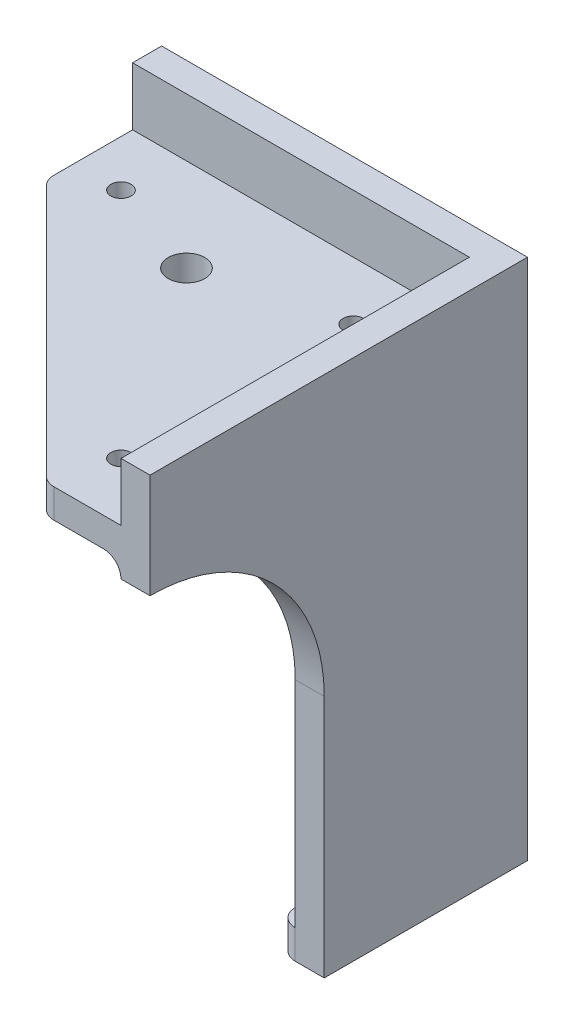
ISO-10303-21;
HEADER;
FILE_DESCRIPTION(('STEP AP214'),'2;1');
FILE_NAME('part.step','',(''),(''),'','','');
FILE_SCHEMA(('AUTOMOTIVE_DESIGN { 1 0 10303 214 1 1 1 1 }'));
ENDSEC;
DATA;
#1=APPLICATION_CONTEXT('core data for automotive mechanical design processes');
#2=APPLICATION_PROTOCOL_DEFINITION('international standard','automotive_design',2000,#1);
#3=PRODUCT_CONTEXT('',#1,'mechanical');
#4=PRODUCT('Part','Part','',(#3));
#5=PRODUCT_RELATED_PRODUCT_CATEGORY('part','',(#4));
#6=PRODUCT_DEFINITION_FORMATION('','',#4);
#7=PRODUCT_DEFINITION_CONTEXT('part definition',#1,'design');
#8=PRODUCT_DEFINITION('design','',#6,#7);
#9=PRODUCT_DEFINITION_SHAPE('','',#8);
#10=(LENGTH_UNIT() NAMED_UNIT(*) SI_UNIT(.MILLI.,.METRE.));
#11=(NAMED_UNIT(*) PLANE_ANGLE_UNIT() SI_UNIT($,.RADIAN.));
#12=(NAMED_UNIT(*) SI_UNIT($,.STERADIAN.) SOLID_ANGLE_UNIT());
#13=UNCERTAINTY_MEASURE_WITH_UNIT(LENGTH_MEASURE(1.E-05),#10,'distance_accuracy_value','');
#14=(GEOMETRIC_REPRESENTATION_CONTEXT(3) GLOBAL_UNCERTAINTY_ASSIGNED_CONTEXT((#13)) GLOBAL_UNIT_ASSIGNED_CONTEXT((#10,
#11,#12)) REPRESENTATION_CONTEXT('',''));
#15=CARTESIAN_POINT('',(0.,0.,0.));
#16=DIRECTION('',(0.,0.,1.));
#17=DIRECTION('',(1.,0.,0.));
#18=AXIS2_PLACEMENT_3D('',#15,#16,#17);
#19=CARTESIAN_POINT('',(-63.,-48.,5.));
#20=DIRECTION('',(0.,0.,1.));
#21=DIRECTION('',(1.,0.,0.));
#22=AXIS2_PLACEMENT_3D('',#19,#20,#21);
#23=PLANE('',#22);
#24=DIRECTION('',(0.,-1.,0.));
#25=VECTOR('',#24,1.);
#26=CARTESIAN_POINT('',(-7.99999999999996,-48.,5.));
#27=LINE('',#26,#25);
#28=CARTESIAN_POINT('',(-7.99999999999996,-85.,5.));
#29=VERTEX_POINT('',#28);
#30=CARTESIAN_POINT('',(-7.99999999999997,-18.,5.));
#31=VERTEX_POINT('',#30);
#32=EDGE_CURVE('E322',#29,#31,#27,.F.);
#33=ORIENTED_EDGE('',*,*,#32,.T.);
#34=DIRECTION('',(1.,0.,0.));
#35=VECTOR('',#34,1.);
#36=CARTESIAN_POINT('',(-63.,-18.,5.));
#37=LINE('',#36,#35);
#38=CARTESIAN_POINT('',(-63.,-18.,5.));
#39=VERTEX_POINT('',#38);
#40=EDGE_CURVE('E324',#31,#39,#37,.F.);
#41=ORIENTED_EDGE('',*,*,#40,.T.);
#42=CARTESIAN_POINT('',(-63.,-48.,5.));
#43=DIRECTION('',(0.,0.,-1.));
#44=DIRECTION('',(1.,0.,0.));
#45=AXIS2_PLACEMENT_3D('',#42,#43,#44);
#46=CIRCLE('',#45,30.);
#47=CARTESIAN_POINT('',(-33.,-48.,5.));
#48=VERTEX_POINT('',#47);
#49=EDGE_CURVE('E234',#39,#48,#46,.T.);
#50=ORIENTED_EDGE('',*,*,#49,.T.);
#51=DIRECTION('',(0.,-1.,0.));
#52=VECTOR('',#51,1.);
#53=CARTESIAN_POINT('',(-33.,-90.,5.));
#54=LINE('',#53,#52);
#55=CARTESIAN_POINT('',(-33.,-85.,5.));
#56=VERTEX_POINT('',#55);
#57=EDGE_CURVE('E237',#48,#56,#54,.T.);
#58=ORIENTED_EDGE('',*,*,#57,.T.);
#59=DIRECTION('',(1.,0.,0.));
#60=VECTOR('',#59,1.);
#61=CARTESIAN_POINT('',(-33.,-85.,5.));
#62=LINE('',#61,#60);
#63=EDGE_CURVE('E356',#56,#29,#62,.T.);
#64=ORIENTED_EDGE('',*,*,#63,.T.);
#65=EDGE_LOOP('',(#33,#41,#50,#58,#64));
#66=FACE_BOUND('',#65,.T.);
#67=ADVANCED_FACE('F33',(#66),#23,.T.);
#68=DIRECTION('',(0.,-1.,0.));
#69=VECTOR('',#68,1.);
#70=CARTESIAN_POINT('',(-63.,-18.,5.));
#71=LINE('',#70,#69);
#72=CARTESIAN_POINT('',(-63.,0.,5.));
#73=VERTEX_POINT('',#72);
#74=CARTESIAN_POINT('',(-63.,-10.,5.));
#75=VERTEX_POINT('',#74);
#76=EDGE_CURVE('E206',#73,#75,#71,.T.);
#77=ORIENTED_EDGE('',*,*,#76,.T.);
#78=DIRECTION('',(-1.,0.,0.));
#79=VECTOR('',#78,1.);
#80=CARTESIAN_POINT('',(-4.99999999999996,-10.,5.));
#81=LINE('',#80,#79);
#82=CARTESIAN_POINT('',(-4.99999999999996,-10.,5.));
#83=VERTEX_POINT('',#82);
#84=EDGE_CURVE('E190',#83,#75,#81,.T.);
#85=ORIENTED_EDGE('',*,*,#84,.F.);
#86=DIRECTION('',(0.,-1.,0.));
#87=VECTOR('',#86,1.);
#88=CARTESIAN_POINT('',(-4.99999999999997,0.,5.));
#89=LINE('',#88,#87);
#90=CARTESIAN_POINT('',(-4.99999999999996,0.,5.));
#91=VERTEX_POINT('',#90);
#92=EDGE_CURVE('E203',#91,#83,#89,.T.);
#93=ORIENTED_EDGE('',*,*,#92,.F.);
#94=DIRECTION('',(-1.,0.,0.));
#95=VECTOR('',#94,1.);
#96=CARTESIAN_POINT('',(-63.,0.,5.));
#97=LINE('',#96,#95);
#98=EDGE_CURVE('E224',#91,#73,#97,.T.);
#99=ORIENTED_EDGE('',*,*,#98,.T.);
#100=EDGE_LOOP('',(#77,#85,#93,#99));
#101=FACE_BOUND('',#100,.T.);
#102=ADVANCED_FACE('F202',(#101),#23,.T.);
#103=CARTESIAN_POINT('',(-4.99999999999997,0.,65.));
#104=DIRECTION('',(1.,0.,0.));
#105=DIRECTION('',(0.,1.,0.));
#106=AXIS2_PLACEMENT_3D('',#103,#104,#105);
#107=PLANE('',#106);
#108=CARTESIAN_POINT('',(-4.99999999999998,-48.,65.));
#109=DIRECTION('',(1.,0.,0.));
#110=DIRECTION('',(0.,1.,0.));
#111=AXIS2_PLACEMENT_3D('',#108,#109,#110);
#112=CIRCLE('',#111,30.);
#113=CARTESIAN_POINT('',(-4.99999999999998,-18.,65.));
#114=VERTEX_POINT('',#113);
#115=CARTESIAN_POINT('',(-4.99999999999997,-48.,35.));
#116=VERTEX_POINT('',#115);
#117=EDGE_CURVE('E215',#114,#116,#112,.F.);
#118=ORIENTED_EDGE('',*,*,#117,.F.);
#119=DIRECTION('',(0.,0.,-1.));
#120=VECTOR('',#119,1.);
#121=CARTESIAN_POINT('',(-4.99999999999997,-18.,5.));
#122=LINE('',#121,#120);
#123=CARTESIAN_POINT('',(-4.99999999999997,-18.,8.));
#124=VERTEX_POINT('',#123);
#125=EDGE_CURVE('E50',#114,#124,#122,.T.);
#126=ORIENTED_EDGE('',*,*,#125,.T.);
#127=DIRECTION('',(0.,-1.,0.));
#128=VECTOR('',#127,1.);
#129=CARTESIAN_POINT('',(-4.99999999999997,0.,8.));
#130=LINE('',#129,#128);
#131=CARTESIAN_POINT('',(-4.99999999999996,-85.,8.));
#132=VERTEX_POINT('',#131);
#133=EDGE_CURVE('E54',#124,#132,#130,.T.);
#134=ORIENTED_EDGE('',*,*,#133,.T.);
#135=DIRECTION('',(0.,0.,1.));
#136=VECTOR('',#135,1.);
#137=CARTESIAN_POINT('',(-4.99999999999996,-85.,5.));
#138=LINE('',#137,#136);
#139=CARTESIAN_POINT('',(-4.99999999999996,-85.,35.));
#140=VERTEX_POINT('',#139);
#141=EDGE_CURVE('E359',#132,#140,#138,.T.);
#142=ORIENTED_EDGE('',*,*,#141,.T.);
#143=DIRECTION('',(0.,-1.,0.));
#144=VECTOR('',#143,1.);
#145=CARTESIAN_POINT('',(-4.99999999999996,-90.,35.));
#146=LINE('',#145,#144);
#147=EDGE_CURVE('E219',#116,#140,#146,.T.);
#148=ORIENTED_EDGE('',*,*,#147,.F.);
#149=EDGE_LOOP('',(#118,#126,#134,#142,#148));
#150=FACE_BOUND('',#149,.T.);
#151=ADVANCED_FACE('F427',(#150),#107,.F.);
#152=DIRECTION('',(0.,0.,-1.));
#153=VECTOR('',#152,1.);
#154=CARTESIAN_POINT('',(-4.99999999999996,-10.,123.215118311312));
#155=LINE('',#154,#153);
#156=CARTESIAN_POINT('',(-4.99999999999996,-10.,65.));
#157=VERTEX_POINT('',#156);
#158=EDGE_CURVE('E185',#157,#83,#155,.T.);
#159=ORIENTED_EDGE('',*,*,#158,.F.);
#160=DIRECTION('',(0.,-1.,0.));
#161=VECTOR('',#160,1.);
#162=CARTESIAN_POINT('',(-4.99999999999997,0.,65.));
#163=LINE('',#162,#161);
#164=CARTESIAN_POINT('',(-4.99999999999997,0.,65.));
#165=VERTEX_POINT('',#164);
#166=EDGE_CURVE('E231',#165,#157,#163,.T.);
#167=ORIENTED_EDGE('',*,*,#166,.F.);
#168=DIRECTION('',(0.,0.,-1.));
#169=VECTOR('',#168,1.);
#170=CARTESIAN_POINT('',(-4.99999999999997,0.,65.));
#171=LINE('',#170,#169);
#172=EDGE_CURVE('E213',#165,#91,#171,.T.);
#173=ORIENTED_EDGE('',*,*,#172,.T.);
#174=ORIENTED_EDGE('',*,*,#92,.T.);
#175=EDGE_LOOP('',(#159,#167,#173,#174));
#176=FACE_BOUND('',#175,.T.);
#177=ADVANCED_FACE('F211',(#176),#107,.F.);
#178=CARTESIAN_POINT('',(-63.,-18.,5.));
#179=DIRECTION('',(1.,0.,0.));
#180=DIRECTION('',(0.,1.,0.));
#181=AXIS2_PLACEMENT_3D('',#178,#179,#180);
#182=PLANE('',#181);
#183=DIRECTION('',(0.,0.,-1.));
#184=VECTOR('',#183,1.);
#185=CARTESIAN_POINT('',(-63.,-15.,123.215118311312));
#186=LINE('',#185,#184);
#187=CARTESIAN_POINT('',(-63.,-15.,18.575));
#188=VERTEX_POINT('',#187);
#189=CARTESIAN_POINT('',(-63.,-15.,8.00000000000004));
#190=VERTEX_POINT('',#189);
#191=EDGE_CURVE('E207',#188,#190,#186,.T.);
#192=ORIENTED_EDGE('',*,*,#191,.F.);
#193=DIRECTION('',(0.,1.,0.));
#194=VECTOR('',#193,1.);
#195=CARTESIAN_POINT('',(-63.,-18.,18.575));
#196=LINE('',#195,#194);
#197=CARTESIAN_POINT('',(-63.,-10.,18.575));
#198=VERTEX_POINT('',#197);
#199=EDGE_CURVE('E314',#188,#198,#196,.T.);
#200=ORIENTED_EDGE('',*,*,#199,.T.);
#201=DIRECTION('',(0.,0.,-1.));
#202=VECTOR('',#201,1.);
#203=CARTESIAN_POINT('',(-63.,-10.,123.215118311312));
#204=LINE('',#203,#202);
#205=EDGE_CURVE('E199',#198,#75,#204,.T.);
#206=ORIENTED_EDGE('',*,*,#205,.T.);
#207=ORIENTED_EDGE('',*,*,#76,.F.);
#208=DIRECTION('',(0.,0.,-1.));
#209=VECTOR('',#208,1.);
#210=CARTESIAN_POINT('',(-63.,0.,5.));
#211=LINE('',#210,#209);
#212=CARTESIAN_POINT('',(-63.,0.,0.));
#213=VERTEX_POINT('',#212);
#214=EDGE_CURVE('E255',#73,#213,#211,.T.);
#215=ORIENTED_EDGE('',*,*,#214,.T.);
#216=DIRECTION('',(0.,-1.,0.));
#217=VECTOR('',#216,1.);
#218=CARTESIAN_POINT('',(-63.,-18.,0.));
#219=LINE('',#218,#217);
#220=CARTESIAN_POINT('',(-63.,-18.,0.));
#221=VERTEX_POINT('',#220);
#222=EDGE_CURVE('E241',#213,#221,#219,.T.);
#223=ORIENTED_EDGE('',*,*,#222,.T.);
#224=DIRECTION('',(0.,0.,-1.));
#225=VECTOR('',#224,1.);
#226=CARTESIAN_POINT('',(-63.,-18.,5.));
#227=LINE('',#226,#225);
#228=EDGE_CURVE('E267',#39,#221,#227,.T.);
#229=ORIENTED_EDGE('',*,*,#228,.F.);
#230=CARTESIAN_POINT('',(-63.,-18.,8.00000000000001));
#231=DIRECTION('',(1.,0.,0.));
#232=DIRECTION('',(0.,1.,0.));
#233=AXIS2_PLACEMENT_3D('',#230,#231,#232);
#234=CIRCLE('',#233,3.);
#235=EDGE_CURVE('E42',#39,#190,#234,.T.);
#236=ORIENTED_EDGE('',*,*,#235,.T.);
#237=EDGE_LOOP('',(#192,#200,#206,#207,#215,#223,#229,#236));
#238=FACE_BOUND('',#237,.T.);
#239=ADVANCED_FACE('F404',(#238),#182,.F.);
#240=CARTESIAN_POINT('',(-63.,-48.,5.));
#241=DIRECTION('',(0.,0.,-1.));
#242=DIRECTION('',(-1.,0.,0.));
#243=AXIS2_PLACEMENT_3D('',#240,#241,#242);
#244=CYLINDRICAL_SURFACE('',#243,30.);
#245=CARTESIAN_POINT('',(-63.,-48.,0.));
#246=DIRECTION('',(0.,0.,-1.));
#247=DIRECTION('',(1.,0.,0.));
#248=AXIS2_PLACEMENT_3D('',#245,#246,#247);
#249=CIRCLE('',#248,30.);
#250=CARTESIAN_POINT('',(-33.,-48.,0.));
#251=VERTEX_POINT('',#250);
#252=EDGE_CURVE('E244',#221,#251,#249,.T.);
#253=ORIENTED_EDGE('',*,*,#252,.T.);
#254=DIRECTION('',(0.,0.,-1.));
#255=VECTOR('',#254,1.);
#256=CARTESIAN_POINT('',(-33.,-48.,5.));
#257=LINE('',#256,#255);
#258=EDGE_CURVE('E265',#48,#251,#257,.T.);
#259=ORIENTED_EDGE('',*,*,#258,.F.);
#260=ORIENTED_EDGE('',*,*,#49,.F.);
#261=ORIENTED_EDGE('',*,*,#228,.T.);
#262=EDGE_LOOP('',(#253,#259,#260,#261));
#263=FACE_BOUND('',#262,.T.);
#264=ADVANCED_FACE('F450',(#263),#244,.F.);
#265=CARTESIAN_POINT('',(-33.,-90.,5.));
#266=DIRECTION('',(1.,0.,0.));
#267=DIRECTION('',(0.,0.,-1.));
#268=AXIS2_PLACEMENT_3D('',#265,#266,#267);
#269=PLANE('',#268);
#270=DIRECTION('',(0.,0.,-1.));
#271=VECTOR('',#270,1.);
#272=CARTESIAN_POINT('',(-33.,-90.,5.));
#273=LINE('',#272,#271);
#274=CARTESIAN_POINT('',(-33.,-90.,5.));
#275=VERTEX_POINT('',#274);
#276=CARTESIAN_POINT('',(-33.,-90.,0.));
#277=VERTEX_POINT('',#276);
#278=EDGE_CURVE('E263',#275,#277,#273,.T.);
#279=ORIENTED_EDGE('',*,*,#278,.F.);
#280=DIRECTION('',(0.,-1.,0.));
#281=VECTOR('',#280,1.);
#282=CARTESIAN_POINT('',(-33.,-85.,5.));
#283=LINE('',#282,#281);
#284=EDGE_CURVE('E286',#275,#56,#283,.F.);
#285=ORIENTED_EDGE('',*,*,#284,.T.);
#286=ORIENTED_EDGE('',*,*,#57,.F.);
#287=ORIENTED_EDGE('',*,*,#258,.T.);
#288=DIRECTION('',(0.,-1.,0.));
#289=VECTOR('',#288,1.);
#290=CARTESIAN_POINT('',(-33.,-90.,0.));
#291=LINE('',#290,#289);
#292=EDGE_CURVE('E246',#251,#277,#291,.T.);
#293=ORIENTED_EDGE('',*,*,#292,.T.);
#294=EDGE_LOOP('',(#279,#285,#286,#287,#293));
#295=FACE_BOUND('',#294,.T.);
#296=ADVANCED_FACE('F446',(#295),#269,.F.);
#297=CARTESIAN_POINT('',(0.,-90.,5.));
#298=DIRECTION('',(0.,1.,0.));
#299=DIRECTION('',(0.,0.,1.));
#300=AXIS2_PLACEMENT_3D('',#297,#298,#299);
#301=PLANE('',#300);
#302=DIRECTION('',(-1.,0.,0.));
#303=VECTOR('',#302,1.);
#304=CARTESIAN_POINT('',(-33.,-90.,8.));
#305=LINE('',#304,#303);
#306=CARTESIAN_POINT('',(-7.99999999999996,-90.,8.));
#307=VERTEX_POINT('',#306);
#308=CARTESIAN_POINT('',(-30.,-90.,8.));
#309=VERTEX_POINT('',#308);
#310=EDGE_CURVE('E360',#307,#309,#305,.T.);
#311=ORIENTED_EDGE('',*,*,#310,.T.);
#312=CARTESIAN_POINT('',(-30.,-90.,5.));
#313=DIRECTION('',(0.,1.,0.));
#314=DIRECTION('',(0.,0.,1.));
#315=AXIS2_PLACEMENT_3D('',#312,#313,#314);
#316=CIRCLE('',#315,3.);
#317=EDGE_CURVE('E281',#309,#275,#316,.F.);
#318=ORIENTED_EDGE('',*,*,#317,.T.);
#319=ORIENTED_EDGE('',*,*,#278,.T.);
#320=DIRECTION('',(1.,0.,0.));
#321=VECTOR('',#320,1.);
#322=CARTESIAN_POINT('',(0.,-90.,0.));
#323=LINE('',#322,#321);
#324=CARTESIAN_POINT('',(0.,-90.,0.));
#325=VERTEX_POINT('',#324);
#326=EDGE_CURVE('E249',#277,#325,#323,.T.);
#327=ORIENTED_EDGE('',*,*,#326,.T.);
#328=DIRECTION('',(0.,0.,-1.));
#329=VECTOR('',#328,1.);
#330=CARTESIAN_POINT('',(0.,-90.,5.));
#331=LINE('',#330,#329);
#332=CARTESIAN_POINT('',(0.,-90.,35.));
#333=VERTEX_POINT('',#332);
#334=EDGE_CURVE('E261',#333,#325,#331,.T.);
#335=ORIENTED_EDGE('',*,*,#334,.F.);
#336=DIRECTION('',(1.,0.,0.));
#337=VECTOR('',#336,1.);
#338=CARTESIAN_POINT('',(-82.9999999999999,-90.,35.));
#339=LINE('',#338,#337);
#340=CARTESIAN_POINT('',(-4.99999999999996,-90.,35.));
#341=VERTEX_POINT('',#340);
#342=EDGE_CURVE('E379',#341,#333,#339,.T.);
#343=ORIENTED_EDGE('',*,*,#342,.F.);
#344=CARTESIAN_POINT('',(-4.99999999999996,-90.,32.));
#345=DIRECTION('',(0.,1.,0.));
#346=DIRECTION('',(0.,0.,1.));
#347=AXIS2_PLACEMENT_3D('',#344,#345,#346);
#348=CIRCLE('',#347,3.);
#349=CARTESIAN_POINT('',(-7.99999999999996,-90.,32.));
#350=VERTEX_POINT('',#349);
#351=EDGE_CURVE('E274',#341,#350,#348,.F.);
#352=ORIENTED_EDGE('',*,*,#351,.T.);
#353=DIRECTION('',(0.,0.,-1.));
#354=VECTOR('',#353,1.);
#355=CARTESIAN_POINT('',(-7.99999999999996,-90.,8.));
#356=LINE('',#355,#354);
#357=EDGE_CURVE('E350',#350,#307,#356,.T.);
#358=ORIENTED_EDGE('',*,*,#357,.T.);
#359=EDGE_LOOP('',(#311,#318,#319,#327,#335,#343,#352,#358));
#360=FACE_BOUND('',#359,.T.);
#361=ADVANCED_FACE('F442',(#360),#301,.F.);
#362=CARTESIAN_POINT('',(0.,0.,5.));
#363=DIRECTION('',(-1.,0.,0.));
#364=DIRECTION('',(0.,-1.,0.));
#365=AXIS2_PLACEMENT_3D('',#362,#363,#364);
#366=PLANE('',#365);
#367=DIRECTION('',(0.,1.,0.));
#368=VECTOR('',#367,1.);
#369=CARTESIAN_POINT('',(0.,0.,65.));
#370=LINE('',#369,#368);
#371=CARTESIAN_POINT('',(0.,-18.,65.));
#372=VERTEX_POINT('',#371);
#373=CARTESIAN_POINT('',(0.,0.,65.));
#374=VERTEX_POINT('',#373);
#375=EDGE_CURVE('E214',#372,#374,#370,.T.);
#376=ORIENTED_EDGE('',*,*,#375,.F.);
#377=CARTESIAN_POINT('',(0.,-48.,65.));
#378=DIRECTION('',(1.,0.,0.));
#379=DIRECTION('',(0.,1.,0.));
#380=AXIS2_PLACEMENT_3D('',#377,#378,#379);
#381=CIRCLE('',#380,30.);
#382=CARTESIAN_POINT('',(0.,-48.,35.));
#383=VERTEX_POINT('',#382);
#384=EDGE_CURVE('E377',#383,#372,#381,.T.);
#385=ORIENTED_EDGE('',*,*,#384,.F.);
#386=DIRECTION('',(0.,1.,0.));
#387=VECTOR('',#386,1.);
#388=CARTESIAN_POINT('',(0.,-90.,35.));
#389=LINE('',#388,#387);
#390=EDGE_CURVE('E371',#333,#383,#389,.T.);
#391=ORIENTED_EDGE('',*,*,#390,.F.);
#392=ORIENTED_EDGE('',*,*,#334,.T.);
#393=DIRECTION('',(0.,1.,0.));
#394=VECTOR('',#393,1.);
#395=CARTESIAN_POINT('',(0.,0.,0.));
#396=LINE('',#395,#394);
#397=CARTESIAN_POINT('',(0.,0.,0.));
#398=VERTEX_POINT('',#397);
#399=EDGE_CURVE('E252',#325,#398,#396,.T.);
#400=ORIENTED_EDGE('',*,*,#399,.T.);
#401=DIRECTION('',(0.,0.,-1.));
#402=VECTOR('',#401,1.);
#403=CARTESIAN_POINT('',(0.,0.,5.));
#404=LINE('',#403,#402);
#405=EDGE_CURVE('E258',#374,#398,#404,.T.);
#406=ORIENTED_EDGE('',*,*,#405,.F.);
#407=EDGE_LOOP('',(#376,#385,#391,#392,#400,#406));
#408=FACE_BOUND('',#407,.T.);
#409=ADVANCED_FACE('F438',(#408),#366,.F.);
#410=CARTESIAN_POINT('',(-63.,0.,5.));
#411=DIRECTION('',(0.,-1.,0.));
#412=DIRECTION('',(0.,0.,-1.));
#413=AXIS2_PLACEMENT_3D('',#410,#411,#412);
#414=PLANE('',#413);
#415=DIRECTION('',(-1.,0.,0.));
#416=VECTOR('',#415,1.);
#417=CARTESIAN_POINT('',(-63.,0.,0.));
#418=LINE('',#417,#416);
#419=EDGE_CURVE('E235',#398,#213,#418,.T.);
#420=ORIENTED_EDGE('',*,*,#419,.T.);
#421=ORIENTED_EDGE('',*,*,#214,.F.);
#422=ORIENTED_EDGE('',*,*,#98,.F.);
#423=ORIENTED_EDGE('',*,*,#172,.F.);
#424=DIRECTION('',(-1.,0.,0.));
#425=VECTOR('',#424,1.);
#426=CARTESIAN_POINT('',(0.,0.,65.));
#427=LINE('',#426,#425);
#428=EDGE_CURVE('E217',#374,#165,#427,.T.);
#429=ORIENTED_EDGE('',*,*,#428,.F.);
#430=ORIENTED_EDGE('',*,*,#405,.T.);
#431=EDGE_LOOP('',(#420,#421,#422,#423,#429,#430));
#432=FACE_BOUND('',#431,.T.);
#433=ADVANCED_FACE('F434',(#432),#414,.F.);
#434=CARTESIAN_POINT('',(-63.,-48.,0.));
#435=DIRECTION('',(0.,0.,1.));
#436=DIRECTION('',(1.,0.,0.));
#437=AXIS2_PLACEMENT_3D('',#434,#435,#436);
#438=PLANE('',#437);
#439=ORIENTED_EDGE('',*,*,#222,.F.);
#440=ORIENTED_EDGE('',*,*,#419,.F.);
#441=ORIENTED_EDGE('',*,*,#399,.F.);
#442=ORIENTED_EDGE('',*,*,#326,.F.);
#443=ORIENTED_EDGE('',*,*,#292,.F.);
#444=ORIENTED_EDGE('',*,*,#252,.F.);
#445=EDGE_LOOP('',(#439,#440,#441,#442,#443,#444));
#446=FACE_BOUND('',#445,.T.);
#447=ADVANCED_FACE('F431',(#446),#438,.F.);
#448=CARTESIAN_POINT('',(0.,0.,65.));
#449=DIRECTION('',(0.,0.,-1.));
#450=DIRECTION('',(-1.,0.,0.));
#451=AXIS2_PLACEMENT_3D('',#448,#449,#450);
#452=PLANE('',#451);
#453=DIRECTION('',(1.,0.,0.));
#454=VECTOR('',#453,1.);
#455=CARTESIAN_POINT('',(-4.99999999999996,-10.,65.));
#456=LINE('',#455,#454);
#457=CARTESIAN_POINT('',(-16.5750000000005,-10.,65.));
#458=VERTEX_POINT('',#457);
#459=EDGE_CURVE('E193',#458,#157,#456,.T.);
#460=ORIENTED_EDGE('',*,*,#459,.F.);
#461=DIRECTION('',(0.,1.,0.));
#462=VECTOR('',#461,1.);
#463=CARTESIAN_POINT('',(-16.5750000000005,0.,65.));
#464=LINE('',#463,#462);
#465=CARTESIAN_POINT('',(-16.5750000000005,-15.,65.));
#466=VERTEX_POINT('',#465);
#467=EDGE_CURVE('E307',#458,#466,#464,.F.);
#468=ORIENTED_EDGE('',*,*,#467,.T.);
#469=DIRECTION('',(-1.,0.,0.));
#470=VECTOR('',#469,1.);
#471=CARTESIAN_POINT('',(-4.99999999999996,-15.,65.));
#472=LINE('',#471,#470);
#473=CARTESIAN_POINT('',(-7.99999999999997,-15.,65.));
#474=VERTEX_POINT('',#473);
#475=EDGE_CURVE('E198',#474,#466,#472,.T.);
#476=ORIENTED_EDGE('',*,*,#475,.F.);
#477=CARTESIAN_POINT('',(-7.99999999999997,-18.,65.));
#478=DIRECTION('',(0.,0.,-1.));
#479=DIRECTION('',(-1.,0.,0.));
#480=AXIS2_PLACEMENT_3D('',#477,#478,#479);
#481=CIRCLE('',#480,3.);
#482=EDGE_CURVE('E11',#474,#114,#481,.T.);
#483=ORIENTED_EDGE('',*,*,#482,.T.);
#484=DIRECTION('',(1.,0.,0.));
#485=VECTOR('',#484,1.);
#486=CARTESIAN_POINT('',(-83.,-18.,65.));
#487=LINE('',#486,#485);
#488=EDGE_CURVE('E373',#114,#372,#487,.T.);
#489=ORIENTED_EDGE('',*,*,#488,.T.);
#490=ORIENTED_EDGE('',*,*,#375,.T.);
#491=ORIENTED_EDGE('',*,*,#428,.T.);
#492=ORIENTED_EDGE('',*,*,#166,.T.);
#493=EDGE_LOOP('',(#460,#468,#476,#483,#489,#490,#491,#492));
#494=FACE_BOUND('',#493,.T.);
#495=ADVANCED_FACE('F386',(#494),#452,.F.);
#496=CARTESIAN_POINT('',(-82.9999999999999,-48.,65.));
#497=DIRECTION('',(1.,0.,0.));
#498=DIRECTION('',(0.,1.,0.));
#499=AXIS2_PLACEMENT_3D('',#496,#497,#498);
#500=CYLINDRICAL_SURFACE('',#499,30.);
#501=ORIENTED_EDGE('',*,*,#117,.T.);
#502=DIRECTION('',(1.,0.,0.));
#503=VECTOR('',#502,1.);
#504=CARTESIAN_POINT('',(-82.9999999999999,-48.,35.));
#505=LINE('',#504,#503);
#506=EDGE_CURVE('E382',#116,#383,#505,.T.);
#507=ORIENTED_EDGE('',*,*,#506,.T.);
#508=ORIENTED_EDGE('',*,*,#384,.T.);
#509=ORIENTED_EDGE('',*,*,#488,.F.);
#510=EDGE_LOOP('',(#501,#507,#508,#509));
#511=FACE_BOUND('',#510,.T.);
#512=ADVANCED_FACE('F574',(#511),#500,.F.);
#513=CARTESIAN_POINT('',(-82.9999999999999,-90.,35.));
#514=DIRECTION('',(0.,0.,-1.));
#515=DIRECTION('',(0.,1.,0.));
#516=AXIS2_PLACEMENT_3D('',#513,#514,#515);
#517=PLANE('',#516);
#518=ORIENTED_EDGE('',*,*,#147,.T.);
#519=DIRECTION('',(0.,-1.,0.));
#520=VECTOR('',#519,1.);
#521=CARTESIAN_POINT('',(-4.99999999999996,-90.,35.));
#522=LINE('',#521,#520);
#523=EDGE_CURVE('E293',#140,#341,#522,.T.);
#524=ORIENTED_EDGE('',*,*,#523,.T.);
#525=ORIENTED_EDGE('',*,*,#342,.T.);
#526=ORIENTED_EDGE('',*,*,#390,.T.);
#527=ORIENTED_EDGE('',*,*,#506,.F.);
#528=EDGE_LOOP('',(#518,#524,#525,#526,#527));
#529=FACE_BOUND('',#528,.T.);
#530=ADVANCED_FACE('F643',(#529),#517,.F.);
#531=CARTESIAN_POINT('',(-33.,-85.,8.));
#532=DIRECTION('',(0.,0.,1.));
#533=DIRECTION('',(1.,0.,0.));
#534=AXIS2_PLACEMENT_3D('',#531,#532,#533);
#535=PLANE('',#534);
#536=DIRECTION('',(-1.,0.,0.));
#537=VECTOR('',#536,1.);
#538=CARTESIAN_POINT('',(-33.,-85.,8.));
#539=LINE('',#538,#537);
#540=CARTESIAN_POINT('',(-7.99999999999996,-85.,8.));
#541=VERTEX_POINT('',#540);
#542=CARTESIAN_POINT('',(-30.,-85.,8.));
#543=VERTEX_POINT('',#542);
#544=EDGE_CURVE('E364',#541,#543,#539,.T.);
#545=ORIENTED_EDGE('',*,*,#544,.T.);
#546=DIRECTION('',(0.,-1.,0.));
#547=VECTOR('',#546,1.);
#548=CARTESIAN_POINT('',(-30.,-90.,8.));
#549=LINE('',#548,#547);
#550=EDGE_CURVE('E269',#543,#309,#549,.T.);
#551=ORIENTED_EDGE('',*,*,#550,.T.);
#552=ORIENTED_EDGE('',*,*,#310,.F.);
#553=DIRECTION('',(0.,-1.,0.));
#554=VECTOR('',#553,1.);
#555=CARTESIAN_POINT('',(-7.99999999999996,-85.,8.));
#556=LINE('',#555,#554);
#557=EDGE_CURVE('E366',#541,#307,#556,.T.);
#558=ORIENTED_EDGE('',*,*,#557,.F.);
#559=EDGE_LOOP('',(#545,#551,#552,#558));
#560=FACE_BOUND('',#559,.T.);
#561=ADVANCED_FACE('F634',(#560),#535,.T.);
#562=CARTESIAN_POINT('',(-7.99999999999996,-85.,8.));
#563=DIRECTION('',(-1.,0.,0.));
#564=DIRECTION('',(0.,-1.,0.));
#565=AXIS2_PLACEMENT_3D('',#562,#563,#564);
#566=PLANE('',#565);
#567=ORIENTED_EDGE('',*,*,#357,.F.);
#568=DIRECTION('',(0.,-1.,0.));
#569=VECTOR('',#568,1.);
#570=CARTESIAN_POINT('',(-7.99999999999996,-85.,32.));
#571=LINE('',#570,#569);
#572=CARTESIAN_POINT('',(-7.99999999999996,-85.,32.));
#573=VERTEX_POINT('',#572);
#574=EDGE_CURVE('E296',#350,#573,#571,.F.);
#575=ORIENTED_EDGE('',*,*,#574,.T.);
#576=DIRECTION('',(0.,0.,-1.));
#577=VECTOR('',#576,1.);
#578=CARTESIAN_POINT('',(-7.99999999999996,-85.,8.));
#579=LINE('',#578,#577);
#580=EDGE_CURVE('E362',#573,#541,#579,.T.);
#581=ORIENTED_EDGE('',*,*,#580,.T.);
#582=ORIENTED_EDGE('',*,*,#557,.T.);
#583=EDGE_LOOP('',(#567,#575,#581,#582));
#584=FACE_BOUND('',#583,.T.);
#585=ADVANCED_FACE('F626',(#584),#566,.T.);
#586=CARTESIAN_POINT('',(0.,-85.,0.));
#587=DIRECTION('',(0.,1.,0.));
#588=DIRECTION('',(0.,0.,1.));
#589=AXIS2_PLACEMENT_3D('',#586,#587,#588);
#590=PLANE('',#589);
#591=ORIENTED_EDGE('',*,*,#141,.F.);
#592=CARTESIAN_POINT('',(-7.99999999999996,-85.,8.));
#593=DIRECTION('',(0.,1.,0.));
#594=DIRECTION('',(0.,0.,1.));
#595=AXIS2_PLACEMENT_3D('',#592,#593,#594);
#596=CIRCLE('',#595,3.);
#597=EDGE_CURVE('E328',#132,#29,#596,.T.);
#598=ORIENTED_EDGE('',*,*,#597,.T.);
#599=ORIENTED_EDGE('',*,*,#63,.F.);
#600=CARTESIAN_POINT('',(-30.,-85.,5.));
#601=DIRECTION('',(0.,1.,0.));
#602=DIRECTION('',(0.,0.,1.));
#603=AXIS2_PLACEMENT_3D('',#600,#601,#602);
#604=CIRCLE('',#603,3.);
#605=EDGE_CURVE('E291',#56,#543,#604,.T.);
#606=ORIENTED_EDGE('',*,*,#605,.T.);
#607=ORIENTED_EDGE('',*,*,#544,.F.);
#608=ORIENTED_EDGE('',*,*,#580,.F.);
#609=CARTESIAN_POINT('',(-4.99999999999996,-85.,32.));
#610=DIRECTION('',(0.,1.,0.));
#611=DIRECTION('',(0.,0.,1.));
#612=AXIS2_PLACEMENT_3D('',#609,#610,#611);
#613=CIRCLE('',#612,3.);
#614=EDGE_CURVE('E288',#573,#140,#613,.T.);
#615=ORIENTED_EDGE('',*,*,#614,.T.);
#616=EDGE_LOOP('',(#591,#598,#599,#606,#607,#608,#615));
#617=FACE_BOUND('',#616,.T.);
#618=ADVANCED_FACE('F460',(#617),#590,.T.);
#619=CARTESIAN_POINT('',(-30.,-85.,5.));
#620=DIRECTION('',(0.,1.,0.));
#621=DIRECTION('',(0.,0.,1.));
#622=AXIS2_PLACEMENT_3D('',#619,#620,#621);
#623=CYLINDRICAL_SURFACE('',#622,3.);
#624=ORIENTED_EDGE('',*,*,#605,.F.);
#625=ORIENTED_EDGE('',*,*,#284,.F.);
#626=ORIENTED_EDGE('',*,*,#317,.F.);
#627=ORIENTED_EDGE('',*,*,#550,.F.);
#628=EDGE_LOOP('',(#624,#625,#626,#627));
#629=FACE_BOUND('',#628,.T.);
#630=ADVANCED_FACE('F456',(#629),#623,.T.);
#631=CARTESIAN_POINT('',(-4.99999999999996,-90.,32.));
#632=DIRECTION('',(0.,1.,0.));
#633=DIRECTION('',(0.,0.,1.));
#634=AXIS2_PLACEMENT_3D('',#631,#632,#633);
#635=CYLINDRICAL_SURFACE('',#634,3.);
#636=ORIENTED_EDGE('',*,*,#614,.F.);
#637=ORIENTED_EDGE('',*,*,#574,.F.);
#638=ORIENTED_EDGE('',*,*,#351,.F.);
#639=ORIENTED_EDGE('',*,*,#523,.F.);
#640=EDGE_LOOP('',(#636,#637,#638,#639));
#641=FACE_BOUND('',#640,.T.);
#642=ADVANCED_FACE('F459',(#641),#635,.T.);
#643=CARTESIAN_POINT('',(-4.99999999999996,-15.,123.215118311312));
#644=DIRECTION('',(0.,1.,0.));
#645=DIRECTION('',(-1.,0.,0.));
#646=AXIS2_PLACEMENT_3D('',#643,#644,#645);
#647=PLANE('',#646);
#648=CARTESIAN_POINT('',(-37.7443449655,-15.,20.97500000001));
#649=DIRECTION('',(0.,1.,0.));
#650=DIRECTION('',(-1.,0.,0.));
#651=AXIS2_PLACEMENT_3D('',#648,#649,#650);
#652=CIRCLE('',#651,3.15);
#653=CARTESIAN_POINT('',(-40.8943449655,-15.,20.97500000001));
#654=VERTEX_POINT('',#653);
#655=EDGE_CURVE('E759',#654,#654,#652,.F.);
#656=ORIENTED_EDGE('',*,*,#655,.F.);
#657=EDGE_LOOP('',(#656));
#658=FACE_BOUND('',#657,.T.);
#659=CARTESIAN_POINT('',(-55.,-15.,15.));
#660=DIRECTION('',(0.,1.,0.));
#661=DIRECTION('',(-1.,0.,0.));
#662=AXIS2_PLACEMENT_3D('',#659,#660,#661);
#663=CIRCLE('',#662,1.75);
#664=CARTESIAN_POINT('',(-56.75,-15.,15.));
#665=VERTEX_POINT('',#664);
#666=EDGE_CURVE('E763',#665,#665,#663,.F.);
#667=ORIENTED_EDGE('',*,*,#666,.F.);
#668=EDGE_LOOP('',(#667));
#669=FACE_BOUND('',#668,.T.);
#670=CARTESIAN_POINT('',(-15.,-15.,15.));
#671=DIRECTION('',(0.,1.,0.));
#672=DIRECTION('',(-1.,0.,0.));
#673=AXIS2_PLACEMENT_3D('',#670,#671,#672);
#674=CIRCLE('',#673,1.75);
#675=CARTESIAN_POINT('',(-16.75,-15.,15.));
#676=VERTEX_POINT('',#675);
#677=EDGE_CURVE('E767',#676,#676,#674,.F.);
#678=ORIENTED_EDGE('',*,*,#677,.F.);
#679=EDGE_LOOP('',(#678));
#680=FACE_BOUND('',#679,.T.);
#681=CARTESIAN_POINT('',(-15.,-15.,55.));
#682=DIRECTION('',(0.,1.,0.));
#683=DIRECTION('',(-1.,0.,0.));
#684=AXIS2_PLACEMENT_3D('',#681,#682,#683);
#685=CIRCLE('',#684,1.75);
#686=CARTESIAN_POINT('',(-16.75,-15.,55.));
#687=VERTEX_POINT('',#686);
#688=EDGE_CURVE('E333',#687,#687,#685,.F.);
#689=ORIENTED_EDGE('',*,*,#688,.F.);
#690=EDGE_LOOP('',(#689));
#691=FACE_BOUND('',#690,.T.);
#692=ORIENTED_EDGE('',*,*,#191,.T.);
#693=DIRECTION('',(1.,0.,0.));
#694=VECTOR('',#693,1.);
#695=CARTESIAN_POINT('',(-4.99999999999996,-15.,8.00000000000001));
#696=LINE('',#695,#694);
#697=CARTESIAN_POINT('',(-7.99999999999997,-15.,8.00000000000001));
#698=VERTEX_POINT('',#697);
#699=EDGE_CURVE('E319',#190,#698,#696,.T.);
#700=ORIENTED_EDGE('',*,*,#699,.T.);
#701=DIRECTION('',(0.,0.,-1.));
#702=VECTOR('',#701,1.);
#703=CARTESIAN_POINT('',(-7.99999999999997,-15.,65.));
#704=LINE('',#703,#702);
#705=EDGE_CURVE('E317',#698,#474,#704,.F.);
#706=ORIENTED_EDGE('',*,*,#705,.T.);
#707=ORIENTED_EDGE('',*,*,#475,.T.);
#708=CARTESIAN_POINT('',(-16.5750000000005,-15.,62.));
#709=DIRECTION('',(0.,1.,0.));
#710=DIRECTION('',(-1.,0.,0.));
#711=AXIS2_PLACEMENT_3D('',#708,#709,#710);
#712=CIRCLE('',#711,3.);
#713=CARTESIAN_POINT('',(-18.6963203435601,-15.,64.1213203435596));
#714=VERTEX_POINT('',#713);
#715=EDGE_CURVE('E312',#466,#714,#712,.F.);
#716=ORIENTED_EDGE('',*,*,#715,.T.);
#717=DIRECTION('',(0.707106781186544,0.,0.707106781186551));
#718=VECTOR('',#717,1.);
#719=CARTESIAN_POINT('',(-63.,-15.,19.8176406871193));
#720=LINE('',#719,#718);
#721=CARTESIAN_POINT('',(-62.1213203435597,-15.,20.6963203435596));
#722=VERTEX_POINT('',#721);
#723=EDGE_CURVE('E208',#722,#714,#720,.T.);
#724=ORIENTED_EDGE('',*,*,#723,.F.);
#725=CARTESIAN_POINT('',(-60.,-15.,18.575));
#726=DIRECTION('',(0.,1.,0.));
#727=DIRECTION('',(-1.,0.,0.));
#728=AXIS2_PLACEMENT_3D('',#725,#726,#727);
#729=CIRCLE('',#728,3.);
#730=EDGE_CURVE('E310',#722,#188,#729,.F.);
#731=ORIENTED_EDGE('',*,*,#730,.T.);
#732=EDGE_LOOP('',(#692,#700,#706,#707,#716,#724,#731));
#733=FACE_BOUND('',#732,.T.);
#734=ADVANCED_FACE('F395',(#658,#669,#680,#691,#733),#647,.F.);
#735=CARTESIAN_POINT('',(-4.99999999999996,-10.,123.215118311312));
#736=DIRECTION('',(0.,-1.,0.));
#737=DIRECTION('',(1.,0.,0.));
#738=AXIS2_PLACEMENT_3D('',#735,#736,#737);
#739=PLANE('',#738);
#740=CARTESIAN_POINT('',(-37.7443449655,-10.,20.97500000001));
#741=DIRECTION('',(0.,1.,0.));
#742=DIRECTION('',(-1.,0.,0.));
#743=AXIS2_PLACEMENT_3D('',#740,#741,#742);
#744=CIRCLE('',#743,3.15);
#745=CARTESIAN_POINT('',(-40.8943449655,-10.,20.97500000001));
#746=VERTEX_POINT('',#745);
#747=EDGE_CURVE('E783',#746,#746,#744,.T.);
#748=ORIENTED_EDGE('',*,*,#747,.F.);
#749=EDGE_LOOP('',(#748));
#750=FACE_BOUND('',#749,.T.);
#751=CARTESIAN_POINT('',(-55.,-10.,15.));
#752=DIRECTION('',(0.,1.,0.));
#753=DIRECTION('',(-1.,0.,0.));
#754=AXIS2_PLACEMENT_3D('',#751,#752,#753);
#755=CIRCLE('',#754,1.75);
#756=CARTESIAN_POINT('',(-56.75,-10.,15.));
#757=VERTEX_POINT('',#756);
#758=EDGE_CURVE('E779',#757,#757,#755,.T.);
#759=ORIENTED_EDGE('',*,*,#758,.F.);
#760=EDGE_LOOP('',(#759));
#761=FACE_BOUND('',#760,.T.);
#762=CARTESIAN_POINT('',(-15.,-10.,15.));
#763=DIRECTION('',(0.,1.,0.));
#764=DIRECTION('',(-1.,0.,0.));
#765=AXIS2_PLACEMENT_3D('',#762,#763,#764);
#766=CIRCLE('',#765,1.75);
#767=CARTESIAN_POINT('',(-16.75,-10.,15.));
#768=VERTEX_POINT('',#767);
#769=EDGE_CURVE('E775',#768,#768,#766,.T.);
#770=ORIENTED_EDGE('',*,*,#769,.F.);
#771=EDGE_LOOP('',(#770));
#772=FACE_BOUND('',#771,.T.);
#773=CARTESIAN_POINT('',(-15.,-10.,55.));
#774=DIRECTION('',(0.,1.,0.));
#775=DIRECTION('',(-1.,0.,0.));
#776=AXIS2_PLACEMENT_3D('',#773,#774,#775);
#777=CIRCLE('',#776,1.75);
#778=CARTESIAN_POINT('',(-16.75,-10.,55.));
#779=VERTEX_POINT('',#778);
#780=EDGE_CURVE('E770',#779,#779,#777,.T.);
#781=ORIENTED_EDGE('',*,*,#780,.F.);
#782=EDGE_LOOP('',(#781));
#783=FACE_BOUND('',#782,.T.);
#784=DIRECTION('',(-0.707106781186544,0.,-0.707106781186551));
#785=VECTOR('',#784,1.);
#786=CARTESIAN_POINT('',(-63.,-10.,19.8176406871193));
#787=LINE('',#786,#785);
#788=CARTESIAN_POINT('',(-18.6963203435601,-10.,64.1213203435596));
#789=VERTEX_POINT('',#788);
#790=CARTESIAN_POINT('',(-62.1213203435597,-10.,20.6963203435596));
#791=VERTEX_POINT('',#790);
#792=EDGE_CURVE('E339',#789,#791,#787,.T.);
#793=ORIENTED_EDGE('',*,*,#792,.F.);
#794=CARTESIAN_POINT('',(-16.5750000000005,-9.99999999999999,62.));
#795=DIRECTION('',(0.,-1.,0.));
#796=DIRECTION('',(1.,0.,0.));
#797=AXIS2_PLACEMENT_3D('',#794,#795,#796);
#798=CIRCLE('',#797,3.);
#799=EDGE_CURVE('E305',#789,#458,#798,.F.);
#800=ORIENTED_EDGE('',*,*,#799,.T.);
#801=ORIENTED_EDGE('',*,*,#459,.T.);
#802=ORIENTED_EDGE('',*,*,#158,.T.);
#803=ORIENTED_EDGE('',*,*,#84,.T.);
#804=ORIENTED_EDGE('',*,*,#205,.F.);
#805=CARTESIAN_POINT('',(-60.,-10.,18.575));
#806=DIRECTION('',(0.,-1.,0.));
#807=DIRECTION('',(1.,0.,0.));
#808=AXIS2_PLACEMENT_3D('',#805,#806,#807);
#809=CIRCLE('',#808,3.);
#810=EDGE_CURVE('E303',#198,#791,#809,.F.);
#811=ORIENTED_EDGE('',*,*,#810,.T.);
#812=EDGE_LOOP('',(#793,#800,#801,#802,#803,#804,#811));
#813=FACE_BOUND('',#812,.T.);
#814=ADVANCED_FACE('F188',(#750,#761,#772,#783,#813),#739,.F.);
#815=CARTESIAN_POINT('',(-63.,-78.8975053202899,19.8176406871193));
#816=DIRECTION('',(0.707106781186551,0.,-0.707106781186544));
#817=DIRECTION('',(-0.707106781186544,0.,-0.707106781186551));
#818=AXIS2_PLACEMENT_3D('',#815,#816,#817);
#819=PLANE('',#818);
#820=ORIENTED_EDGE('',*,*,#723,.T.);
#821=DIRECTION('',(0.,1.,0.));
#822=VECTOR('',#821,1.);
#823=CARTESIAN_POINT('',(-18.6963203435601,-78.8975053202899,64.1213203435596));
#824=LINE('',#823,#822);
#825=EDGE_CURVE('E300',#714,#789,#824,.T.);
#826=ORIENTED_EDGE('',*,*,#825,.T.);
#827=ORIENTED_EDGE('',*,*,#792,.T.);
#828=DIRECTION('',(0.,1.,0.));
#829=VECTOR('',#828,1.);
#830=CARTESIAN_POINT('',(-62.1213203435596,-78.8975053202899,20.6963203435597));
#831=LINE('',#830,#829);
#832=EDGE_CURVE('E298',#791,#722,#831,.F.);
#833=ORIENTED_EDGE('',*,*,#832,.T.);
#834=EDGE_LOOP('',(#820,#826,#827,#833));
#835=FACE_BOUND('',#834,.T.);
#836=ADVANCED_FACE('F397',(#835),#819,.F.);
#837=CARTESIAN_POINT('',(-16.5750000000004,-78.8975053202899,62.));
#838=DIRECTION('',(0.,1.,0.));
#839=DIRECTION('',(-1.,0.,0.));
#840=AXIS2_PLACEMENT_3D('',#837,#838,#839);
#841=CYLINDRICAL_SURFACE('',#840,3.);
#842=ORIENTED_EDGE('',*,*,#715,.F.);
#843=ORIENTED_EDGE('',*,*,#467,.F.);
#844=ORIENTED_EDGE('',*,*,#799,.F.);
#845=ORIENTED_EDGE('',*,*,#825,.F.);
#846=EDGE_LOOP('',(#842,#843,#844,#845));
#847=FACE_BOUND('',#846,.T.);
#848=ADVANCED_FACE('F391',(#847),#841,.T.);
#849=CARTESIAN_POINT('',(-60.,-18.,18.575));
#850=DIRECTION('',(0.,1.,0.));
#851=DIRECTION('',(-1.,0.,0.));
#852=AXIS2_PLACEMENT_3D('',#849,#850,#851);
#853=CYLINDRICAL_SURFACE('',#852,3.);
#854=ORIENTED_EDGE('',*,*,#730,.F.);
#855=ORIENTED_EDGE('',*,*,#832,.F.);
#856=ORIENTED_EDGE('',*,*,#810,.F.);
#857=ORIENTED_EDGE('',*,*,#199,.F.);
#858=EDGE_LOOP('',(#854,#855,#856,#857));
#859=FACE_BOUND('',#858,.T.);
#860=ADVANCED_FACE('F399',(#859),#853,.T.);
#861=CARTESIAN_POINT('',(-7.99999999999997,-18.,65.));
#862=DIRECTION('',(0.,0.,1.));
#863=DIRECTION('',(1.,0.,0.));
#864=AXIS2_PLACEMENT_3D('',#861,#862,#863);
#865=CYLINDRICAL_SURFACE('',#864,3.);
#866=ORIENTED_EDGE('',*,*,#482,.F.);
#867=ORIENTED_EDGE('',*,*,#705,.F.);
#868=CARTESIAN_POINT('',(-7.99999999999997,-18.,8.));
#869=DIRECTION('',(0.,0.,1.));
#870=DIRECTION('',(0.,-1.,0.));
#871=AXIS2_PLACEMENT_3D('',#868,#869,#870);
#872=CIRCLE('',#871,3.);
#873=EDGE_CURVE('E37',#124,#698,#872,.T.);
#874=ORIENTED_EDGE('',*,*,#873,.F.);
#875=ORIENTED_EDGE('',*,*,#125,.F.);
#876=EDGE_LOOP('',(#866,#867,#874,#875));
#877=FACE_BOUND('',#876,.T.);
#878=ADVANCED_FACE('F35',(#877),#865,.F.);
#879=CARTESIAN_POINT('',(-7.99999999999997,0.,8.));
#880=DIRECTION('',(0.,-1.,0.));
#881=DIRECTION('',(1.,0.,0.));
#882=AXIS2_PLACEMENT_3D('',#879,#880,#881);
#883=CYLINDRICAL_SURFACE('',#882,3.);
#884=ORIENTED_EDGE('',*,*,#597,.F.);
#885=ORIENTED_EDGE('',*,*,#133,.F.);
#886=CARTESIAN_POINT('',(-7.99999999999997,-18.,8.));
#887=DIRECTION('',(0.,-1.,0.));
#888=DIRECTION('',(1.,0.,0.));
#889=AXIS2_PLACEMENT_3D('',#886,#887,#888);
#890=CIRCLE('',#889,3.);
#891=EDGE_CURVE('E332',#31,#124,#890,.T.);
#892=ORIENTED_EDGE('',*,*,#891,.F.);
#893=ORIENTED_EDGE('',*,*,#32,.F.);
#894=EDGE_LOOP('',(#884,#885,#892,#893));
#895=FACE_BOUND('',#894,.T.);
#896=ADVANCED_FACE('F413',(#895),#883,.F.);
#897=CARTESIAN_POINT('',(-7.99999999999997,-18.,8.));
#898=DIRECTION('',(0.,0.,1.));
#899=DIRECTION('',(1.,0.,0.));
#900=AXIS2_PLACEMENT_3D('',#897,#898,#899);
#901=SPHERICAL_SURFACE('',#900,3.);
#902=ORIENTED_EDGE('',*,*,#891,.T.);
#903=ORIENTED_EDGE('',*,*,#873,.T.);
#904=CARTESIAN_POINT('',(-7.99999999999997,-18.,8.00000000000001));
#905=DIRECTION('',(-1.,0.,0.));
#906=DIRECTION('',(0.,0.,1.));
#907=AXIS2_PLACEMENT_3D('',#904,#905,#906);
#908=CIRCLE('',#907,3.);
#909=EDGE_CURVE('E331',#31,#698,#908,.F.);
#910=ORIENTED_EDGE('',*,*,#909,.F.);
#911=EDGE_LOOP('',(#902,#903,#910));
#912=FACE_BOUND('',#911,.T.);
#913=ADVANCED_FACE('F418',(#912),#901,.F.);
#914=CARTESIAN_POINT('',(-4.99999999999996,-18.,8.00000000000001));
#915=DIRECTION('',(1.,0.,0.));
#916=DIRECTION('',(0.,1.,0.));
#917=AXIS2_PLACEMENT_3D('',#914,#915,#916);
#918=CYLINDRICAL_SURFACE('',#917,3.);
#919=ORIENTED_EDGE('',*,*,#235,.F.);
#920=ORIENTED_EDGE('',*,*,#40,.F.);
#921=ORIENTED_EDGE('',*,*,#909,.T.);
#922=ORIENTED_EDGE('',*,*,#699,.F.);
#923=EDGE_LOOP('',(#919,#920,#921,#922));
#924=FACE_BOUND('',#923,.T.);
#925=ADVANCED_FACE('F408',(#924),#918,.F.);
#926=CARTESIAN_POINT('',(-15.,-23.9095454429505,55.));
#927=DIRECTION('',(0.,1.,0.));
#928=DIRECTION('',(-1.,0.,0.));
#929=AXIS2_PLACEMENT_3D('',#926,#927,#928);
#930=CYLINDRICAL_SURFACE('',#929,1.75);
#931=ORIENTED_EDGE('',*,*,#688,.T.);
#932=EDGE_LOOP('',(#931));
#933=FACE_BOUND('',#932,.T.);
#934=ORIENTED_EDGE('',*,*,#780,.T.);
#935=EDGE_LOOP('',(#934));
#936=FACE_BOUND('',#935,.T.);
#937=ADVANCED_FACE('F469',(#933,#936),#930,.F.);
#938=CARTESIAN_POINT('',(-15.,-23.9095454429505,15.));
#939=DIRECTION('',(0.,1.,0.));
#940=DIRECTION('',(-1.,0.,0.));
#941=AXIS2_PLACEMENT_3D('',#938,#939,#940);
#942=CYLINDRICAL_SURFACE('',#941,1.75);
#943=ORIENTED_EDGE('',*,*,#677,.T.);
#944=EDGE_LOOP('',(#943));
#945=FACE_BOUND('',#944,.T.);
#946=ORIENTED_EDGE('',*,*,#769,.T.);
#947=EDGE_LOOP('',(#946));
#948=FACE_BOUND('',#947,.T.);
#949=ADVANCED_FACE('F486',(#945,#948),#942,.F.);
#950=CARTESIAN_POINT('',(-55.,-23.9095454429505,15.));
#951=DIRECTION('',(0.,1.,0.));
#952=DIRECTION('',(-1.,0.,0.));
#953=AXIS2_PLACEMENT_3D('',#950,#951,#952);
#954=CYLINDRICAL_SURFACE('',#953,1.75);
#955=ORIENTED_EDGE('',*,*,#666,.T.);
#956=EDGE_LOOP('',(#955));
#957=FACE_BOUND('',#956,.T.);
#958=ORIENTED_EDGE('',*,*,#758,.T.);
#959=EDGE_LOOP('',(#958));
#960=FACE_BOUND('',#959,.T.);
#961=ADVANCED_FACE('F495',(#957,#960),#954,.F.);
#962=CARTESIAN_POINT('',(-37.7443449655,-23.9095454429505,20.97500000001));
#963=DIRECTION('',(0.,1.,0.));
#964=DIRECTION('',(-1.,0.,0.));
#965=AXIS2_PLACEMENT_3D('',#962,#963,#964);
#966=CYLINDRICAL_SURFACE('',#965,3.15);
#967=ORIENTED_EDGE('',*,*,#655,.T.);
#968=EDGE_LOOP('',(#967));
#969=FACE_BOUND('',#968,.T.);
#970=ORIENTED_EDGE('',*,*,#747,.T.);
#971=EDGE_LOOP('',(#970));
#972=FACE_BOUND('',#971,.T.);
#973=ADVANCED_FACE('F503',(#969,#972),#966,.F.);
#974=CLOSED_SHELL('',(#67,#102,#151,#177,#239,#264,#296,#361,#409,#433,#447,#495,#512,#530,#561,
#585,#618,#630,#642,#734,#814,#836,#848,#860,#878,#896,#913,#925,#937,#949,#961,#973));
#975=MANIFOLD_SOLID_BREP('B2',#974);
#976=ADVANCED_BREP_SHAPE_REPRESENTATION('',(#18,#975),#14);
#977=SHAPE_DEFINITION_REPRESENTATION(#9,#976);
ENDSEC;
END-ISO-10303-21;
